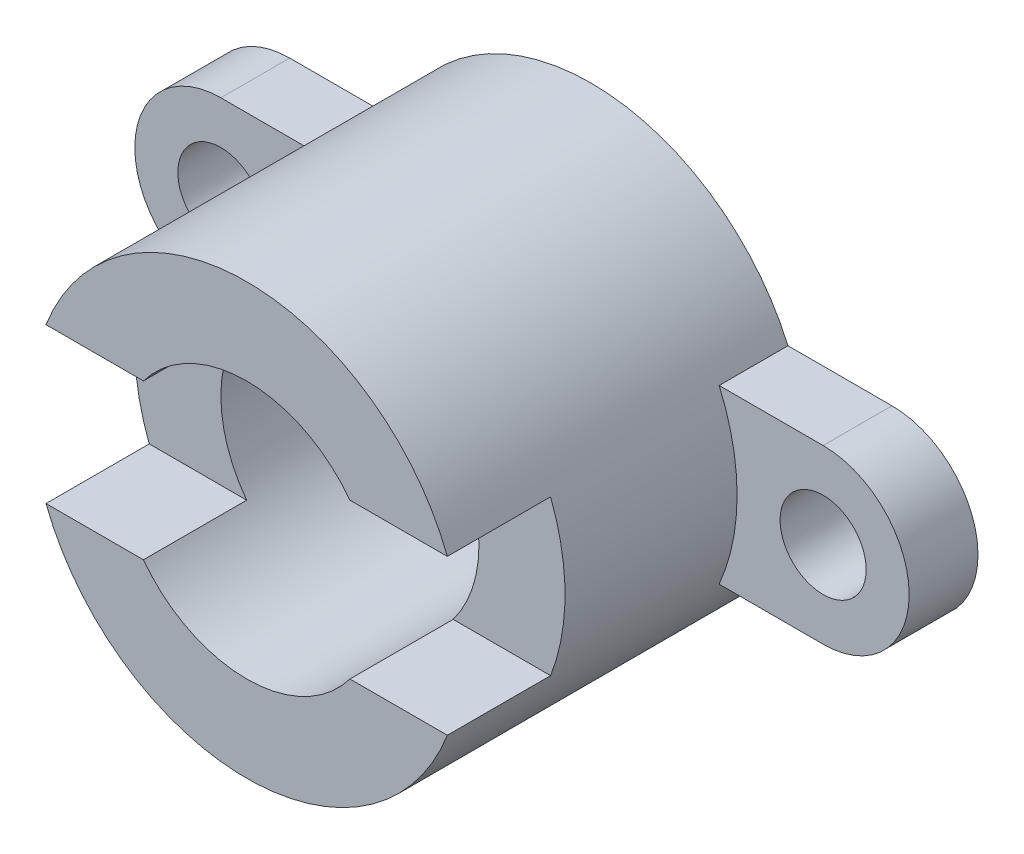
ISO-10303-21;
HEADER;
FILE_DESCRIPTION(('STEP AP214'),'2;1');
FILE_NAME('part.step','',(''),(''),'','','');
FILE_SCHEMA(('AUTOMOTIVE_DESIGN { 1 0 10303 214 1 1 1 1 }'));
ENDSEC;
DATA;
#1=APPLICATION_CONTEXT('core data for automotive mechanical design processes');
#2=APPLICATION_PROTOCOL_DEFINITION('international standard','automotive_design',2000,#1);
#3=PRODUCT_CONTEXT('',#1,'mechanical');
#4=PRODUCT('Part','Part','',(#3));
#5=PRODUCT_RELATED_PRODUCT_CATEGORY('part','',(#4));
#6=PRODUCT_DEFINITION_FORMATION('','',#4);
#7=PRODUCT_DEFINITION_CONTEXT('part definition',#1,'design');
#8=PRODUCT_DEFINITION('design','',#6,#7);
#9=PRODUCT_DEFINITION_SHAPE('','',#8);
#10=(LENGTH_UNIT() NAMED_UNIT(*) SI_UNIT(.MILLI.,.METRE.));
#11=(NAMED_UNIT(*) PLANE_ANGLE_UNIT() SI_UNIT($,.RADIAN.));
#12=(NAMED_UNIT(*) SI_UNIT($,.STERADIAN.) SOLID_ANGLE_UNIT());
#13=UNCERTAINTY_MEASURE_WITH_UNIT(LENGTH_MEASURE(1.E-05),#10,'distance_accuracy_value','');
#14=(GEOMETRIC_REPRESENTATION_CONTEXT(3) GLOBAL_UNCERTAINTY_ASSIGNED_CONTEXT((#13)) GLOBAL_UNIT_ASSIGNED_CONTEXT((#10,
#11,#12)) REPRESENTATION_CONTEXT('',''));
#15=CARTESIAN_POINT('',(0.,0.,0.));
#16=DIRECTION('',(0.,0.,1.));
#17=DIRECTION('',(1.,0.,0.));
#18=AXIS2_PLACEMENT_3D('',#15,#16,#17);
#19=CARTESIAN_POINT('',(0.,0.,40.));
#20=DIRECTION('',(0.,0.,-1.));
#21=DIRECTION('',(-1.,0.,0.));
#22=AXIS2_PLACEMENT_3D('',#19,#20,#21);
#23=CYLINDRICAL_SURFACE('',#22,25.);
#24=DIRECTION('',(0.,0.,-1.));
#25=VECTOR('',#24,1.);
#26=CARTESIAN_POINT('',(-22.9128784747792,10.,8.));
#27=LINE('',#26,#25);
#28=CARTESIAN_POINT('',(-22.9128784747792,10.,8.));
#29=VERTEX_POINT('',#28);
#30=CARTESIAN_POINT('',(-22.9128784747792,10.,0.));
#31=VERTEX_POINT('',#30);
#32=EDGE_CURVE('E255',#29,#31,#27,.T.);
#33=ORIENTED_EDGE('',*,*,#32,.F.);
#34=CARTESIAN_POINT('',(0.,0.,8.));
#35=DIRECTION('',(0.,0.,1.));
#36=DIRECTION('',(1.,0.,0.));
#37=AXIS2_PLACEMENT_3D('',#34,#35,#36);
#38=CIRCLE('',#37,25.);
#39=CARTESIAN_POINT('',(-22.9128784747792,-10.,8.));
#40=VERTEX_POINT('',#39);
#41=EDGE_CURVE('E226',#29,#40,#38,.T.);
#42=ORIENTED_EDGE('',*,*,#41,.T.);
#43=DIRECTION('',(0.,0.,-1.));
#44=VECTOR('',#43,1.);
#45=CARTESIAN_POINT('',(-22.9128784747792,-10.,8.));
#46=LINE('',#45,#44);
#47=CARTESIAN_POINT('',(-22.9128784747792,-10.,0.));
#48=VERTEX_POINT('',#47);
#49=EDGE_CURVE('E240',#40,#48,#46,.T.);
#50=ORIENTED_EDGE('',*,*,#49,.T.);
#51=CARTESIAN_POINT('',(0.,0.,0.));
#52=DIRECTION('',(0.,0.,1.));
#53=DIRECTION('',(1.,0.,0.));
#54=AXIS2_PLACEMENT_3D('',#51,#52,#53);
#55=CIRCLE('',#54,25.);
#56=CARTESIAN_POINT('',(22.9128784747792,-9.99999999999997,0.));
#57=VERTEX_POINT('',#56);
#58=EDGE_CURVE('E186',#57,#48,#55,.F.);
#59=ORIENTED_EDGE('',*,*,#58,.F.);
#60=DIRECTION('',(0.,0.,-1.));
#61=VECTOR('',#60,1.);
#62=CARTESIAN_POINT('',(22.9128784747792,-9.99999999999997,8.));
#63=LINE('',#62,#61);
#64=CARTESIAN_POINT('',(22.9128784747792,-9.99999999999997,8.));
#65=VERTEX_POINT('',#64);
#66=EDGE_CURVE('E286',#65,#57,#63,.T.);
#67=ORIENTED_EDGE('',*,*,#66,.F.);
#68=CARTESIAN_POINT('',(0.,0.,8.));
#69=DIRECTION('',(0.,0.,1.));
#70=DIRECTION('',(1.,0.,0.));
#71=AXIS2_PLACEMENT_3D('',#68,#69,#70);
#72=CIRCLE('',#71,25.);
#73=CARTESIAN_POINT('',(22.9128784747792,10.,8.));
#74=VERTEX_POINT('',#73);
#75=EDGE_CURVE('E265',#74,#65,#72,.F.);
#76=ORIENTED_EDGE('',*,*,#75,.F.);
#77=DIRECTION('',(0.,0.,-1.));
#78=VECTOR('',#77,1.);
#79=CARTESIAN_POINT('',(22.9128784747792,10.,8.));
#80=LINE('',#79,#78);
#81=CARTESIAN_POINT('',(22.9128784747792,10.,0.));
#82=VERTEX_POINT('',#81);
#83=EDGE_CURVE('E288',#74,#82,#80,.T.);
#84=ORIENTED_EDGE('',*,*,#83,.T.);
#85=EDGE_CURVE('E190',#31,#82,#55,.F.);
#86=ORIENTED_EDGE('',*,*,#85,.F.);
#87=EDGE_LOOP('',(#33,#42,#50,#59,#67,#76,#84,#86));
#88=FACE_BOUND('',#87,.T.);
#89=CARTESIAN_POINT('',(0.,0.,40.));
#90=DIRECTION('',(0.,0.,1.));
#91=DIRECTION('',(1.,0.,0.));
#92=AXIS2_PLACEMENT_3D('',#89,#90,#91);
#93=CIRCLE('',#92,25.);
#94=CARTESIAN_POINT('',(-23.3238075793812,8.99999999999999,40.));
#95=VERTEX_POINT('',#94);
#96=CARTESIAN_POINT('',(23.3238075793812,8.99999999999999,40.));
#97=VERTEX_POINT('',#96);
#98=EDGE_CURVE('E182',#95,#97,#93,.F.);
#99=ORIENTED_EDGE('',*,*,#98,.T.);
#100=DIRECTION('',(0.,0.,-1.));
#101=VECTOR('',#100,1.);
#102=CARTESIAN_POINT('',(23.3238075793812,8.99999999999999,40.));
#103=LINE('',#102,#101);
#104=CARTESIAN_POINT('',(23.3238075793812,9.,28.));
#105=VERTEX_POINT('',#104);
#106=EDGE_CURVE('E211',#97,#105,#103,.T.);
#107=ORIENTED_EDGE('',*,*,#106,.T.);
#108=CARTESIAN_POINT('',(0.,0.,28.));
#109=DIRECTION('',(0.,0.,1.));
#110=DIRECTION('',(0.,-1.,0.));
#111=AXIS2_PLACEMENT_3D('',#108,#109,#110);
#112=CIRCLE('',#111,25.);
#113=CARTESIAN_POINT('',(23.3238075793812,-9.00000000000001,28.));
#114=VERTEX_POINT('',#113);
#115=EDGE_CURVE('E221',#105,#114,#112,.F.);
#116=ORIENTED_EDGE('',*,*,#115,.T.);
#117=DIRECTION('',(0.,0.,-1.));
#118=VECTOR('',#117,1.);
#119=CARTESIAN_POINT('',(23.3238075793812,-9.,40.));
#120=LINE('',#119,#118);
#121=CARTESIAN_POINT('',(23.3238075793812,-9.,40.));
#122=VERTEX_POINT('',#121);
#123=EDGE_CURVE('E209',#114,#122,#120,.F.);
#124=ORIENTED_EDGE('',*,*,#123,.T.);
#125=CARTESIAN_POINT('',(-23.3238075793812,-9.,40.));
#126=VERTEX_POINT('',#125);
#127=EDGE_CURVE('E179',#122,#126,#93,.F.);
#128=ORIENTED_EDGE('',*,*,#127,.T.);
#129=DIRECTION('',(0.,0.,-1.));
#130=VECTOR('',#129,1.);
#131=CARTESIAN_POINT('',(-23.3238075793812,-9.,40.));
#132=LINE('',#131,#130);
#133=CARTESIAN_POINT('',(-23.3238075793812,-9.00000000000001,28.));
#134=VERTEX_POINT('',#133);
#135=EDGE_CURVE('E69',#126,#134,#132,.T.);
#136=ORIENTED_EDGE('',*,*,#135,.T.);
#137=CARTESIAN_POINT('',(-23.3238075793812,9.,28.));
#138=VERTEX_POINT('',#137);
#139=EDGE_CURVE('E222',#134,#138,#112,.F.);
#140=ORIENTED_EDGE('',*,*,#139,.T.);
#141=DIRECTION('',(0.,0.,-1.));
#142=VECTOR('',#141,1.);
#143=CARTESIAN_POINT('',(-23.3238075793812,8.99999999999999,40.));
#144=LINE('',#143,#142);
#145=EDGE_CURVE('E219',#138,#95,#144,.F.);
#146=ORIENTED_EDGE('',*,*,#145,.T.);
#147=EDGE_LOOP('',(#99,#107,#116,#124,#128,#136,#140,#146));
#148=FACE_BOUND('',#147,.T.);
#149=ADVANCED_FACE('F47',(#88,#148),#23,.T.);
#150=CARTESIAN_POINT('',(0.,0.,40.));
#151=DIRECTION('',(0.,0.,-1.));
#152=DIRECTION('',(-1.,0.,0.));
#153=AXIS2_PLACEMENT_3D('',#150,#151,#152);
#154=CYLINDRICAL_SURFACE('',#153,15.);
#155=CARTESIAN_POINT('',(0.,0.,0.));
#156=DIRECTION('',(0.,0.,1.));
#157=DIRECTION('',(1.,0.,0.));
#158=AXIS2_PLACEMENT_3D('',#155,#156,#157);
#159=CIRCLE('',#158,15.);
#160=CARTESIAN_POINT('',(15.,0.,0.));
#161=VERTEX_POINT('',#160);
#162=EDGE_CURVE('E189',#161,#161,#159,.T.);
#163=ORIENTED_EDGE('',*,*,#162,.F.);
#164=EDGE_LOOP('',(#163));
#165=FACE_BOUND('',#164,.T.);
#166=CARTESIAN_POINT('',(0.,0.,28.));
#167=DIRECTION('',(0.,0.,1.));
#168=DIRECTION('',(0.,-1.,0.));
#169=AXIS2_PLACEMENT_3D('',#166,#167,#168);
#170=CIRCLE('',#169,15.);
#171=CARTESIAN_POINT('',(12.,-9.00000000000001,28.));
#172=VERTEX_POINT('',#171);
#173=CARTESIAN_POINT('',(12.,9.,28.));
#174=VERTEX_POINT('',#173);
#175=EDGE_CURVE('E13',#172,#174,#170,.T.);
#176=ORIENTED_EDGE('',*,*,#175,.T.);
#177=DIRECTION('',(0.,0.,-1.));
#178=VECTOR('',#177,1.);
#179=CARTESIAN_POINT('',(12.,8.99999999999999,40.));
#180=LINE('',#179,#178);
#181=CARTESIAN_POINT('',(12.,8.99999999999999,40.));
#182=VERTEX_POINT('',#181);
#183=EDGE_CURVE('E205',#174,#182,#180,.F.);
#184=ORIENTED_EDGE('',*,*,#183,.T.);
#185=CARTESIAN_POINT('',(0.,0.,40.));
#186=DIRECTION('',(0.,0.,1.));
#187=DIRECTION('',(1.,0.,0.));
#188=AXIS2_PLACEMENT_3D('',#185,#186,#187);
#189=CIRCLE('',#188,15.);
#190=CARTESIAN_POINT('',(-12.,8.99999999999999,40.));
#191=VERTEX_POINT('',#190);
#192=EDGE_CURVE('E168',#182,#191,#189,.T.);
#193=ORIENTED_EDGE('',*,*,#192,.T.);
#194=DIRECTION('',(0.,0.,-1.));
#195=VECTOR('',#194,1.);
#196=CARTESIAN_POINT('',(-12.,8.99999999999999,40.));
#197=LINE('',#196,#195);
#198=CARTESIAN_POINT('',(-12.,9.,28.));
#199=VERTEX_POINT('',#198);
#200=EDGE_CURVE('E204',#191,#199,#197,.T.);
#201=ORIENTED_EDGE('',*,*,#200,.T.);
#202=CARTESIAN_POINT('',(-12.,-9.00000000000001,28.));
#203=VERTEX_POINT('',#202);
#204=EDGE_CURVE('E50',#199,#203,#170,.T.);
#205=ORIENTED_EDGE('',*,*,#204,.T.);
#206=DIRECTION('',(0.,0.,-1.));
#207=VECTOR('',#206,1.);
#208=CARTESIAN_POINT('',(-12.,-9.,40.));
#209=LINE('',#208,#207);
#210=CARTESIAN_POINT('',(-12.,-9.,40.));
#211=VERTEX_POINT('',#210);
#212=EDGE_CURVE('E161',#203,#211,#209,.F.);
#213=ORIENTED_EDGE('',*,*,#212,.T.);
#214=CARTESIAN_POINT('',(12.,-9.,40.));
#215=VERTEX_POINT('',#214);
#216=EDGE_CURVE('E174',#211,#215,#189,.T.);
#217=ORIENTED_EDGE('',*,*,#216,.T.);
#218=DIRECTION('',(0.,0.,-1.));
#219=VECTOR('',#218,1.);
#220=CARTESIAN_POINT('',(12.,-9.,40.));
#221=LINE('',#220,#219);
#222=EDGE_CURVE('E61',#215,#172,#221,.T.);
#223=ORIENTED_EDGE('',*,*,#222,.T.);
#224=EDGE_LOOP('',(#176,#184,#193,#201,#205,#213,#217,#223));
#225=FACE_BOUND('',#224,.T.);
#226=ADVANCED_FACE('F173',(#165,#225),#154,.F.);
#227=CARTESIAN_POINT('',(0.,0.,40.));
#228=DIRECTION('',(0.,0.,1.));
#229=DIRECTION('',(1.,0.,0.));
#230=AXIS2_PLACEMENT_3D('',#227,#228,#229);
#231=PLANE('',#230);
#232=ORIENTED_EDGE('',*,*,#98,.F.);
#233=DIRECTION('',(1.,0.,0.));
#234=VECTOR('',#233,1.);
#235=CARTESIAN_POINT('',(0.,8.99999999999999,40.));
#236=LINE('',#235,#234);
#237=EDGE_CURVE('E194',#95,#191,#236,.T.);
#238=ORIENTED_EDGE('',*,*,#237,.T.);
#239=ORIENTED_EDGE('',*,*,#192,.F.);
#240=EDGE_CURVE('E192',#182,#97,#236,.T.);
#241=ORIENTED_EDGE('',*,*,#240,.T.);
#242=EDGE_LOOP('',(#232,#238,#239,#241));
#243=FACE_BOUND('',#242,.T.);
#244=ADVANCED_FACE('F200',(#243),#231,.T.);
#245=ORIENTED_EDGE('',*,*,#127,.F.);
#246=DIRECTION('',(-1.,0.,0.));
#247=VECTOR('',#246,1.);
#248=CARTESIAN_POINT('',(0.,-9.,40.));
#249=LINE('',#248,#247);
#250=EDGE_CURVE('E167',#122,#215,#249,.T.);
#251=ORIENTED_EDGE('',*,*,#250,.T.);
#252=ORIENTED_EDGE('',*,*,#216,.F.);
#253=EDGE_CURVE('E158',#211,#126,#249,.T.);
#254=ORIENTED_EDGE('',*,*,#253,.T.);
#255=EDGE_LOOP('',(#245,#251,#252,#254));
#256=FACE_BOUND('',#255,.T.);
#257=ADVANCED_FACE('F178',(#256),#231,.T.);
#258=CARTESIAN_POINT('',(0.,0.,0.));
#259=DIRECTION('',(0.,0.,1.));
#260=DIRECTION('',(1.,0.,0.));
#261=AXIS2_PLACEMENT_3D('',#258,#259,#260);
#262=PLANE('',#261);
#263=ORIENTED_EDGE('',*,*,#58,.T.);
#264=DIRECTION('',(1.,0.,0.));
#265=VECTOR('',#264,1.);
#266=CARTESIAN_POINT('',(0.,-10.,0.));
#267=LINE('',#266,#265);
#268=CARTESIAN_POINT('',(-35.,-9.99999999999999,0.));
#269=VERTEX_POINT('',#268);
#270=EDGE_CURVE('E244',#269,#48,#267,.T.);
#271=ORIENTED_EDGE('',*,*,#270,.F.);
#272=CARTESIAN_POINT('',(-35.,0.,0.));
#273=DIRECTION('',(0.,0.,1.));
#274=DIRECTION('',(1.,0.,0.));
#275=AXIS2_PLACEMENT_3D('',#272,#273,#274);
#276=CIRCLE('',#275,9.99999999999999);
#277=CARTESIAN_POINT('',(-35.,9.99999999999999,0.));
#278=VERTEX_POINT('',#277);
#279=EDGE_CURVE('E242',#278,#269,#276,.T.);
#280=ORIENTED_EDGE('',*,*,#279,.F.);
#281=DIRECTION('',(1.,0.,0.));
#282=VECTOR('',#281,1.);
#283=CARTESIAN_POINT('',(0.,10.,0.));
#284=LINE('',#283,#282);
#285=EDGE_CURVE('E225',#278,#31,#284,.T.);
#286=ORIENTED_EDGE('',*,*,#285,.T.);
#287=ORIENTED_EDGE('',*,*,#85,.T.);
#288=DIRECTION('',(-1.,0.,0.));
#289=VECTOR('',#288,1.);
#290=CARTESIAN_POINT('',(0.,10.,0.));
#291=LINE('',#290,#289);
#292=CARTESIAN_POINT('',(35.,10.,0.));
#293=VERTEX_POINT('',#292);
#294=EDGE_CURVE('E276',#293,#82,#291,.T.);
#295=ORIENTED_EDGE('',*,*,#294,.F.);
#296=CARTESIAN_POINT('',(35.,0.,0.));
#297=DIRECTION('',(0.,0.,1.));
#298=DIRECTION('',(1.,0.,0.));
#299=AXIS2_PLACEMENT_3D('',#296,#297,#298);
#300=CIRCLE('',#299,10.);
#301=CARTESIAN_POINT('',(35.,-10.,0.));
#302=VERTEX_POINT('',#301);
#303=EDGE_CURVE('E263',#293,#302,#300,.F.);
#304=ORIENTED_EDGE('',*,*,#303,.T.);
#305=DIRECTION('',(-1.,0.,0.));
#306=VECTOR('',#305,1.);
#307=CARTESIAN_POINT('',(0.,-9.99999999999991,0.));
#308=LINE('',#307,#306);
#309=EDGE_CURVE('E279',#302,#57,#308,.T.);
#310=ORIENTED_EDGE('',*,*,#309,.T.);
#311=EDGE_LOOP('',(#263,#271,#280,#286,#287,#295,#304,#310));
#312=FACE_BOUND('',#311,.T.);
#313=ORIENTED_EDGE('',*,*,#162,.T.);
#314=EDGE_LOOP('',(#313));
#315=FACE_BOUND('',#314,.T.);
#316=CARTESIAN_POINT('',(35.,0.,0.));
#317=DIRECTION('',(0.,0.,1.));
#318=DIRECTION('',(1.,0.,0.));
#319=AXIS2_PLACEMENT_3D('',#316,#317,#318);
#320=CIRCLE('',#319,5.);
#321=CARTESIAN_POINT('',(40.,0.,0.));
#322=VERTEX_POINT('',#321);
#323=EDGE_CURVE('E258',#322,#322,#320,.F.);
#324=ORIENTED_EDGE('',*,*,#323,.F.);
#325=EDGE_LOOP('',(#324));
#326=FACE_BOUND('',#325,.T.);
#327=CARTESIAN_POINT('',(-35.,0.,0.));
#328=DIRECTION('',(0.,0.,1.));
#329=DIRECTION('',(1.,0.,0.));
#330=AXIS2_PLACEMENT_3D('',#327,#328,#329);
#331=CIRCLE('',#330,5.);
#332=CARTESIAN_POINT('',(-30.,0.,0.));
#333=VERTEX_POINT('',#332);
#334=EDGE_CURVE('E230',#333,#333,#331,.T.);
#335=ORIENTED_EDGE('',*,*,#334,.T.);
#336=EDGE_LOOP('',(#335));
#337=FACE_BOUND('',#336,.T.);
#338=ADVANCED_FACE('F296',(#312,#315,#326,#337),#262,.F.);
#339=CARTESIAN_POINT('',(0.,10.,8.));
#340=DIRECTION('',(0.,-1.,0.));
#341=DIRECTION('',(1.,0.,0.));
#342=AXIS2_PLACEMENT_3D('',#339,#340,#341);
#343=PLANE('',#342);
#344=ORIENTED_EDGE('',*,*,#294,.T.);
#345=ORIENTED_EDGE('',*,*,#83,.F.);
#346=DIRECTION('',(-1.,0.,0.));
#347=VECTOR('',#346,1.);
#348=CARTESIAN_POINT('',(0.,10.,8.));
#349=LINE('',#348,#347);
#350=CARTESIAN_POINT('',(35.,10.,8.));
#351=VERTEX_POINT('',#350);
#352=EDGE_CURVE('E262',#351,#74,#349,.T.);
#353=ORIENTED_EDGE('',*,*,#352,.F.);
#354=DIRECTION('',(0.,0.,-1.));
#355=VECTOR('',#354,1.);
#356=CARTESIAN_POINT('',(35.,10.,8.));
#357=LINE('',#356,#355);
#358=EDGE_CURVE('E273',#351,#293,#357,.T.);
#359=ORIENTED_EDGE('',*,*,#358,.T.);
#360=EDGE_LOOP('',(#344,#345,#353,#359));
#361=FACE_BOUND('',#360,.T.);
#362=ADVANCED_FACE('F303',(#361),#343,.F.);
#363=CARTESIAN_POINT('',(0.,-9.99999999999991,8.));
#364=DIRECTION('',(0.,-1.,0.));
#365=DIRECTION('',(1.,0.,0.));
#366=AXIS2_PLACEMENT_3D('',#363,#364,#365);
#367=PLANE('',#366);
#368=ORIENTED_EDGE('',*,*,#309,.F.);
#369=DIRECTION('',(0.,0.,-1.));
#370=VECTOR('',#369,1.);
#371=CARTESIAN_POINT('',(35.,-10.,8.));
#372=LINE('',#371,#370);
#373=CARTESIAN_POINT('',(35.,-10.,8.));
#374=VERTEX_POINT('',#373);
#375=EDGE_CURVE('E284',#374,#302,#372,.T.);
#376=ORIENTED_EDGE('',*,*,#375,.F.);
#377=DIRECTION('',(-1.,0.,0.));
#378=VECTOR('',#377,1.);
#379=CARTESIAN_POINT('',(0.,-9.99999999999991,8.));
#380=LINE('',#379,#378);
#381=EDGE_CURVE('E267',#374,#65,#380,.T.);
#382=ORIENTED_EDGE('',*,*,#381,.T.);
#383=ORIENTED_EDGE('',*,*,#66,.T.);
#384=EDGE_LOOP('',(#368,#376,#382,#383));
#385=FACE_BOUND('',#384,.T.);
#386=ADVANCED_FACE('F313',(#385),#367,.T.);
#387=CARTESIAN_POINT('',(35.,0.,8.));
#388=DIRECTION('',(0.,0.,-1.));
#389=DIRECTION('',(-1.,0.,0.));
#390=AXIS2_PLACEMENT_3D('',#387,#388,#389);
#391=CYLINDRICAL_SURFACE('',#390,5.);
#392=CARTESIAN_POINT('',(35.,0.,8.));
#393=DIRECTION('',(0.,0.,1.));
#394=DIRECTION('',(1.,0.,0.));
#395=AXIS2_PLACEMENT_3D('',#392,#393,#394);
#396=CIRCLE('',#395,5.);
#397=CARTESIAN_POINT('',(40.,0.,8.));
#398=VERTEX_POINT('',#397);
#399=EDGE_CURVE('E259',#398,#398,#396,.F.);
#400=ORIENTED_EDGE('',*,*,#399,.F.);
#401=EDGE_LOOP('',(#400));
#402=FACE_BOUND('',#401,.T.);
#403=ORIENTED_EDGE('',*,*,#323,.T.);
#404=EDGE_LOOP('',(#403));
#405=FACE_BOUND('',#404,.T.);
#406=ADVANCED_FACE('F353',(#402,#405),#391,.F.);
#407=CARTESIAN_POINT('',(35.,0.,8.));
#408=DIRECTION('',(0.,0.,-1.));
#409=DIRECTION('',(-1.,0.,0.));
#410=AXIS2_PLACEMENT_3D('',#407,#408,#409);
#411=CYLINDRICAL_SURFACE('',#410,10.);
#412=ORIENTED_EDGE('',*,*,#303,.F.);
#413=ORIENTED_EDGE('',*,*,#358,.F.);
#414=CARTESIAN_POINT('',(35.,0.,8.));
#415=DIRECTION('',(0.,0.,1.));
#416=DIRECTION('',(1.,0.,0.));
#417=AXIS2_PLACEMENT_3D('',#414,#415,#416);
#418=CIRCLE('',#417,10.);
#419=EDGE_CURVE('E270',#351,#374,#418,.F.);
#420=ORIENTED_EDGE('',*,*,#419,.T.);
#421=ORIENTED_EDGE('',*,*,#375,.T.);
#422=EDGE_LOOP('',(#412,#413,#420,#421));
#423=FACE_BOUND('',#422,.T.);
#424=ADVANCED_FACE('F307',(#423),#411,.T.);
#425=CARTESIAN_POINT('',(0.,0.,8.));
#426=DIRECTION('',(0.,0.,1.));
#427=DIRECTION('',(1.,0.,0.));
#428=AXIS2_PLACEMENT_3D('',#425,#426,#427);
#429=PLANE('',#428);
#430=ORIENTED_EDGE('',*,*,#399,.T.);
#431=EDGE_LOOP('',(#430));
#432=FACE_BOUND('',#431,.T.);
#433=ORIENTED_EDGE('',*,*,#352,.T.);
#434=ORIENTED_EDGE('',*,*,#75,.T.);
#435=ORIENTED_EDGE('',*,*,#381,.F.);
#436=ORIENTED_EDGE('',*,*,#419,.F.);
#437=EDGE_LOOP('',(#433,#434,#435,#436));
#438=FACE_BOUND('',#437,.T.);
#439=ADVANCED_FACE('F338',(#432,#438),#429,.T.);
#440=CARTESIAN_POINT('',(0.,10.,8.));
#441=DIRECTION('',(0.,1.,0.));
#442=DIRECTION('',(-1.,0.,0.));
#443=AXIS2_PLACEMENT_3D('',#440,#441,#442);
#444=PLANE('',#443);
#445=ORIENTED_EDGE('',*,*,#285,.F.);
#446=DIRECTION('',(0.,0.,-1.));
#447=VECTOR('',#446,1.);
#448=CARTESIAN_POINT('',(-35.,9.99999999999999,8.));
#449=LINE('',#448,#447);
#450=CARTESIAN_POINT('',(-35.,9.99999999999999,8.));
#451=VERTEX_POINT('',#450);
#452=EDGE_CURVE('E253',#451,#278,#449,.T.);
#453=ORIENTED_EDGE('',*,*,#452,.F.);
#454=DIRECTION('',(1.,0.,0.));
#455=VECTOR('',#454,1.);
#456=CARTESIAN_POINT('',(0.,10.,8.));
#457=LINE('',#456,#455);
#458=EDGE_CURVE('E229',#451,#29,#457,.T.);
#459=ORIENTED_EDGE('',*,*,#458,.T.);
#460=ORIENTED_EDGE('',*,*,#32,.T.);
#461=EDGE_LOOP('',(#445,#453,#459,#460));
#462=FACE_BOUND('',#461,.T.);
#463=ADVANCED_FACE('F323',(#462),#444,.T.);
#464=CARTESIAN_POINT('',(-35.,0.,8.));
#465=DIRECTION('',(0.,0.,-1.));
#466=DIRECTION('',(-1.,0.,0.));
#467=AXIS2_PLACEMENT_3D('',#464,#465,#466);
#468=CYLINDRICAL_SURFACE('',#467,9.99999999999999);
#469=ORIENTED_EDGE('',*,*,#279,.T.);
#470=DIRECTION('',(0.,0.,-1.));
#471=VECTOR('',#470,1.);
#472=CARTESIAN_POINT('',(-35.,-9.99999999999999,8.));
#473=LINE('',#472,#471);
#474=CARTESIAN_POINT('',(-35.,-9.99999999999999,8.));
#475=VERTEX_POINT('',#474);
#476=EDGE_CURVE('E250',#475,#269,#473,.T.);
#477=ORIENTED_EDGE('',*,*,#476,.F.);
#478=CARTESIAN_POINT('',(-35.,0.,8.));
#479=DIRECTION('',(0.,0.,1.));
#480=DIRECTION('',(1.,0.,0.));
#481=AXIS2_PLACEMENT_3D('',#478,#479,#480);
#482=CIRCLE('',#481,9.99999999999999);
#483=EDGE_CURVE('E233',#451,#475,#482,.T.);
#484=ORIENTED_EDGE('',*,*,#483,.F.);
#485=ORIENTED_EDGE('',*,*,#452,.T.);
#486=EDGE_LOOP('',(#469,#477,#484,#485));
#487=FACE_BOUND('',#486,.T.);
#488=ADVANCED_FACE('F329',(#487),#468,.T.);
#489=CARTESIAN_POINT('',(0.,-10.,8.));
#490=DIRECTION('',(0.,1.,0.));
#491=DIRECTION('',(-1.,0.,0.));
#492=AXIS2_PLACEMENT_3D('',#489,#490,#491);
#493=PLANE('',#492);
#494=ORIENTED_EDGE('',*,*,#270,.T.);
#495=ORIENTED_EDGE('',*,*,#49,.F.);
#496=DIRECTION('',(1.,0.,0.));
#497=VECTOR('',#496,1.);
#498=CARTESIAN_POINT('',(0.,-10.,8.));
#499=LINE('',#498,#497);
#500=EDGE_CURVE('E235',#475,#40,#499,.T.);
#501=ORIENTED_EDGE('',*,*,#500,.F.);
#502=ORIENTED_EDGE('',*,*,#476,.T.);
#503=EDGE_LOOP('',(#494,#495,#501,#502));
#504=FACE_BOUND('',#503,.T.);
#505=ADVANCED_FACE('F319',(#504),#493,.F.);
#506=CARTESIAN_POINT('',(-35.,0.,8.));
#507=DIRECTION('',(0.,0.,-1.));
#508=DIRECTION('',(-1.,0.,0.));
#509=AXIS2_PLACEMENT_3D('',#506,#507,#508);
#510=CYLINDRICAL_SURFACE('',#509,5.);
#511=CARTESIAN_POINT('',(-35.,0.,8.));
#512=DIRECTION('',(0.,0.,1.));
#513=DIRECTION('',(1.,0.,0.));
#514=AXIS2_PLACEMENT_3D('',#511,#512,#513);
#515=CIRCLE('',#514,5.);
#516=CARTESIAN_POINT('',(-30.,0.,8.));
#517=VERTEX_POINT('',#516);
#518=EDGE_CURVE('E237',#517,#517,#515,.T.);
#519=ORIENTED_EDGE('',*,*,#518,.T.);
#520=EDGE_LOOP('',(#519));
#521=FACE_BOUND('',#520,.T.);
#522=ORIENTED_EDGE('',*,*,#334,.F.);
#523=EDGE_LOOP('',(#522));
#524=FACE_BOUND('',#523,.T.);
#525=ADVANCED_FACE('F336',(#521,#524),#510,.F.);
#526=CARTESIAN_POINT('',(0.,0.,8.));
#527=DIRECTION('',(0.,0.,1.));
#528=DIRECTION('',(1.,0.,0.));
#529=AXIS2_PLACEMENT_3D('',#526,#527,#528);
#530=PLANE('',#529);
#531=ORIENTED_EDGE('',*,*,#41,.F.);
#532=ORIENTED_EDGE('',*,*,#458,.F.);
#533=ORIENTED_EDGE('',*,*,#483,.T.);
#534=ORIENTED_EDGE('',*,*,#500,.T.);
#535=EDGE_LOOP('',(#531,#532,#533,#534));
#536=FACE_BOUND('',#535,.T.);
#537=ORIENTED_EDGE('',*,*,#518,.F.);
#538=EDGE_LOOP('',(#537));
#539=FACE_BOUND('',#538,.T.);
#540=ADVANCED_FACE('F327',(#536,#539),#530,.T.);
#541=CARTESIAN_POINT('',(-43.,8.99999999999999,40.));
#542=DIRECTION('',(0.,-1.,0.));
#543=DIRECTION('',(0.,0.,-1.));
#544=AXIS2_PLACEMENT_3D('',#541,#542,#543);
#545=PLANE('',#544);
#546=DIRECTION('',(1.,0.,0.));
#547=VECTOR('',#546,1.);
#548=CARTESIAN_POINT('',(-43.,9.,28.));
#549=LINE('',#548,#547);
#550=EDGE_CURVE('E176',#138,#199,#549,.T.);
#551=ORIENTED_EDGE('',*,*,#550,.T.);
#552=ORIENTED_EDGE('',*,*,#200,.F.);
#553=ORIENTED_EDGE('',*,*,#237,.F.);
#554=ORIENTED_EDGE('',*,*,#145,.F.);
#555=EDGE_LOOP('',(#551,#552,#553,#554));
#556=FACE_BOUND('',#555,.T.);
#557=ADVANCED_FACE('F381',(#556),#545,.T.);
#558=CARTESIAN_POINT('',(-43.,-9.00000000000001,28.));
#559=DIRECTION('',(0.,1.,0.));
#560=DIRECTION('',(0.,0.,1.));
#561=AXIS2_PLACEMENT_3D('',#558,#559,#560);
#562=PLANE('',#561);
#563=ORIENTED_EDGE('',*,*,#253,.F.);
#564=ORIENTED_EDGE('',*,*,#212,.F.);
#565=DIRECTION('',(1.,0.,0.));
#566=VECTOR('',#565,1.);
#567=CARTESIAN_POINT('',(-43.,-9.00000000000001,28.));
#568=LINE('',#567,#566);
#569=EDGE_CURVE('E405',#134,#203,#568,.T.);
#570=ORIENTED_EDGE('',*,*,#569,.F.);
#571=ORIENTED_EDGE('',*,*,#135,.F.);
#572=EDGE_LOOP('',(#563,#564,#570,#571));
#573=FACE_BOUND('',#572,.T.);
#574=ADVANCED_FACE('F160',(#573),#562,.T.);
#575=CARTESIAN_POINT('',(-43.,9.,28.));
#576=DIRECTION('',(0.,0.,1.));
#577=DIRECTION('',(0.,-1.,0.));
#578=AXIS2_PLACEMENT_3D('',#575,#576,#577);
#579=PLANE('',#578);
#580=ORIENTED_EDGE('',*,*,#569,.T.);
#581=ORIENTED_EDGE('',*,*,#204,.F.);
#582=ORIENTED_EDGE('',*,*,#550,.F.);
#583=ORIENTED_EDGE('',*,*,#139,.F.);
#584=EDGE_LOOP('',(#580,#581,#582,#583));
#585=FACE_BOUND('',#584,.T.);
#586=ADVANCED_FACE('F388',(#585),#579,.T.);
#587=EDGE_CURVE('E409',#174,#105,#549,.T.);
#588=ORIENTED_EDGE('',*,*,#587,.F.);
#589=ORIENTED_EDGE('',*,*,#175,.F.);
#590=EDGE_CURVE('E404',#172,#114,#568,.T.);
#591=ORIENTED_EDGE('',*,*,#590,.T.);
#592=ORIENTED_EDGE('',*,*,#115,.F.);
#593=EDGE_LOOP('',(#588,#589,#591,#592));
#594=FACE_BOUND('',#593,.T.);
#595=ADVANCED_FACE('F391',(#594),#579,.T.);
#596=ORIENTED_EDGE('',*,*,#590,.F.);
#597=ORIENTED_EDGE('',*,*,#222,.F.);
#598=ORIENTED_EDGE('',*,*,#250,.F.);
#599=ORIENTED_EDGE('',*,*,#123,.F.);
#600=EDGE_LOOP('',(#596,#597,#598,#599));
#601=FACE_BOUND('',#600,.T.);
#602=ADVANCED_FACE('F387',(#601),#562,.T.);
#603=ORIENTED_EDGE('',*,*,#240,.F.);
#604=ORIENTED_EDGE('',*,*,#183,.F.);
#605=ORIENTED_EDGE('',*,*,#587,.T.);
#606=ORIENTED_EDGE('',*,*,#106,.F.);
#607=EDGE_LOOP('',(#603,#604,#605,#606));
#608=FACE_BOUND('',#607,.T.);
#609=ADVANCED_FACE('F384',(#608),#545,.T.);
#610=CLOSED_SHELL('',(#149,#226,#244,#257,#338,#362,#386,#406,#424,#439,#463,#488,#505,#525,
#540,#557,#574,#586,#595,#602,#609));
#611=MANIFOLD_SOLID_BREP('B2',#610);
#612=ADVANCED_BREP_SHAPE_REPRESENTATION('',(#18,#611),#14);
#613=SHAPE_DEFINITION_REPRESENTATION(#9,#612);
ENDSEC;
END-ISO-10303-21;
